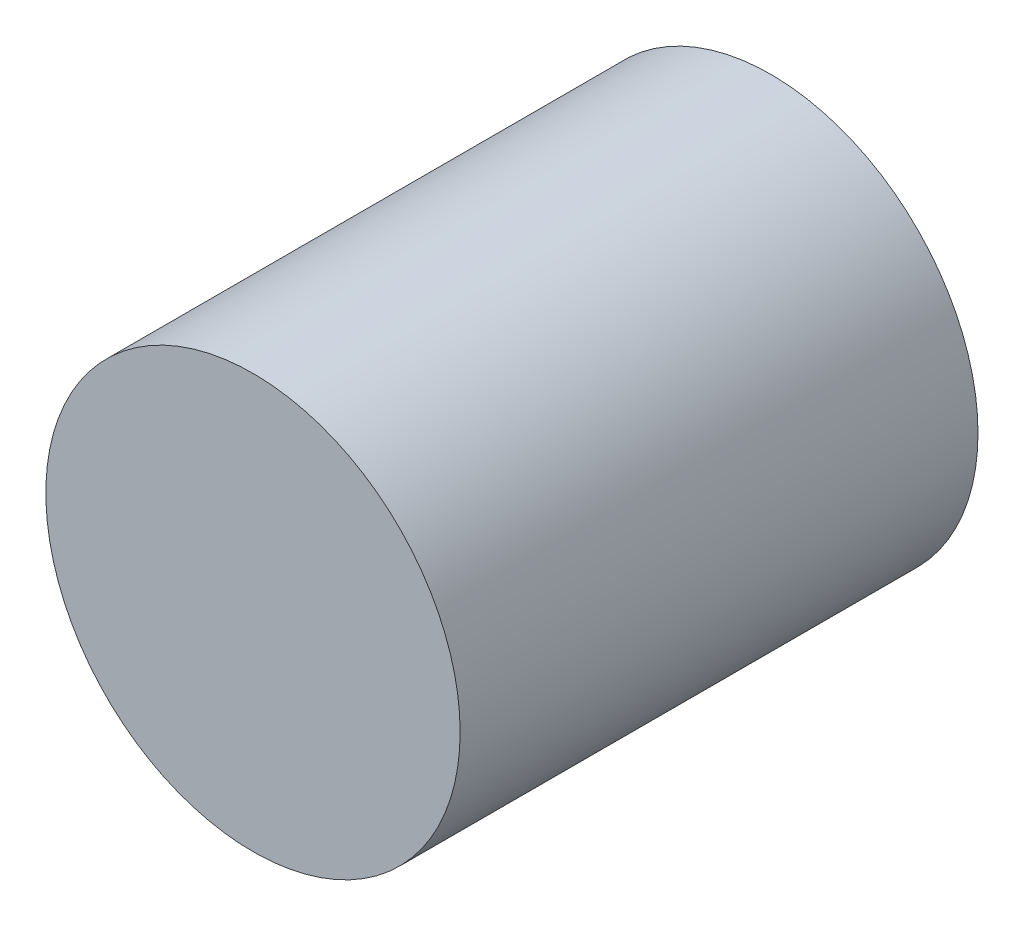
ISO-10303-21;
HEADER;
FILE_DESCRIPTION(('STEP AP214'),'2;1');
FILE_NAME('part.step','',(''),(''),'','','');
FILE_SCHEMA(('AUTOMOTIVE_DESIGN { 1 0 10303 214 1 1 1 1 }'));
ENDSEC;
DATA;
#1=APPLICATION_CONTEXT('core data for automotive mechanical design processes');
#2=APPLICATION_PROTOCOL_DEFINITION('international standard','automotive_design',2000,#1);
#3=PRODUCT_CONTEXT('',#1,'mechanical');
#4=PRODUCT('Part','Part','',(#3));
#5=PRODUCT_RELATED_PRODUCT_CATEGORY('part','',(#4));
#6=PRODUCT_DEFINITION_FORMATION('','',#4);
#7=PRODUCT_DEFINITION_CONTEXT('part definition',#1,'design');
#8=PRODUCT_DEFINITION('design','',#6,#7);
#9=PRODUCT_DEFINITION_SHAPE('','',#8);
#10=(LENGTH_UNIT() NAMED_UNIT(*) SI_UNIT(.MILLI.,.METRE.));
#11=(NAMED_UNIT(*) PLANE_ANGLE_UNIT() SI_UNIT($,.RADIAN.));
#12=(NAMED_UNIT(*) SI_UNIT($,.STERADIAN.) SOLID_ANGLE_UNIT());
#13=UNCERTAINTY_MEASURE_WITH_UNIT(LENGTH_MEASURE(1.E-05),#10,'distance_accuracy_value','');
#14=(GEOMETRIC_REPRESENTATION_CONTEXT(3) GLOBAL_UNCERTAINTY_ASSIGNED_CONTEXT((#13)) GLOBAL_UNIT_ASSIGNED_CONTEXT((#10,
#11,#12)) REPRESENTATION_CONTEXT('',''));
#15=CARTESIAN_POINT('',(0.,0.,0.));
#16=DIRECTION('',(0.,0.,1.));
#17=DIRECTION('',(1.,0.,0.));
#18=AXIS2_PLACEMENT_3D('',#15,#16,#17);
#19=CARTESIAN_POINT('',(0.,0.,735.));
#20=DIRECTION('',(0.,0.,-1.));
#21=DIRECTION('',(-1.,0.,0.));
#22=AXIS2_PLACEMENT_3D('',#19,#20,#21);
#23=CYLINDRICAL_SURFACE('',#22,294.);
#24=CARTESIAN_POINT('',(0.,0.,735.));
#25=DIRECTION('',(0.,0.,1.));
#26=DIRECTION('',(1.,0.,0.));
#27=AXIS2_PLACEMENT_3D('',#24,#25,#26);
#28=CIRCLE('',#27,294.);
#29=CARTESIAN_POINT('',(294.,0.,735.));
#30=VERTEX_POINT('',#29);
#31=EDGE_CURVE('E10',#30,#30,#28,.T.);
#32=ORIENTED_EDGE('',*,*,#31,.F.);
#33=EDGE_LOOP('',(#32));
#34=FACE_BOUND('',#33,.T.);
#35=CARTESIAN_POINT('',(0.,0.,0.));
#36=DIRECTION('',(0.,0.,1.));
#37=DIRECTION('',(1.,0.,0.));
#38=AXIS2_PLACEMENT_3D('',#35,#36,#37);
#39=CIRCLE('',#38,294.);
#40=CARTESIAN_POINT('',(294.,0.,0.));
#41=VERTEX_POINT('',#40);
#42=EDGE_CURVE('E40',#41,#41,#39,.T.);
#43=ORIENTED_EDGE('',*,*,#42,.T.);
#44=EDGE_LOOP('',(#43));
#45=FACE_BOUND('',#44,.T.);
#46=ADVANCED_FACE('F37',(#34,#45),#23,.T.);
#47=CARTESIAN_POINT('',(0.,0.,735.));
#48=DIRECTION('',(0.,0.,1.));
#49=DIRECTION('',(1.,0.,0.));
#50=AXIS2_PLACEMENT_3D('',#47,#48,#49);
#51=PLANE('',#50);
#52=ORIENTED_EDGE('',*,*,#31,.T.);
#53=EDGE_LOOP('',(#52));
#54=FACE_BOUND('',#53,.T.);
#55=ADVANCED_FACE('F54',(#54),#51,.T.);
#56=CARTESIAN_POINT('',(0.,0.,0.));
#57=DIRECTION('',(0.,0.,1.));
#58=DIRECTION('',(1.,0.,0.));
#59=AXIS2_PLACEMENT_3D('',#56,#57,#58);
#60=PLANE('',#59);
#61=ORIENTED_EDGE('',*,*,#42,.F.);
#62=EDGE_LOOP('',(#61));
#63=FACE_BOUND('',#62,.T.);
#64=ADVANCED_FACE('F52',(#63),#60,.F.);
#65=CLOSED_SHELL('',(#46,#55,#64));
#66=MANIFOLD_SOLID_BREP('B2',#65);
#67=ADVANCED_BREP_SHAPE_REPRESENTATION('',(#18,#66),#14);
#68=SHAPE_DEFINITION_REPRESENTATION(#9,#67);
ENDSEC;
END-ISO-10303-21;
